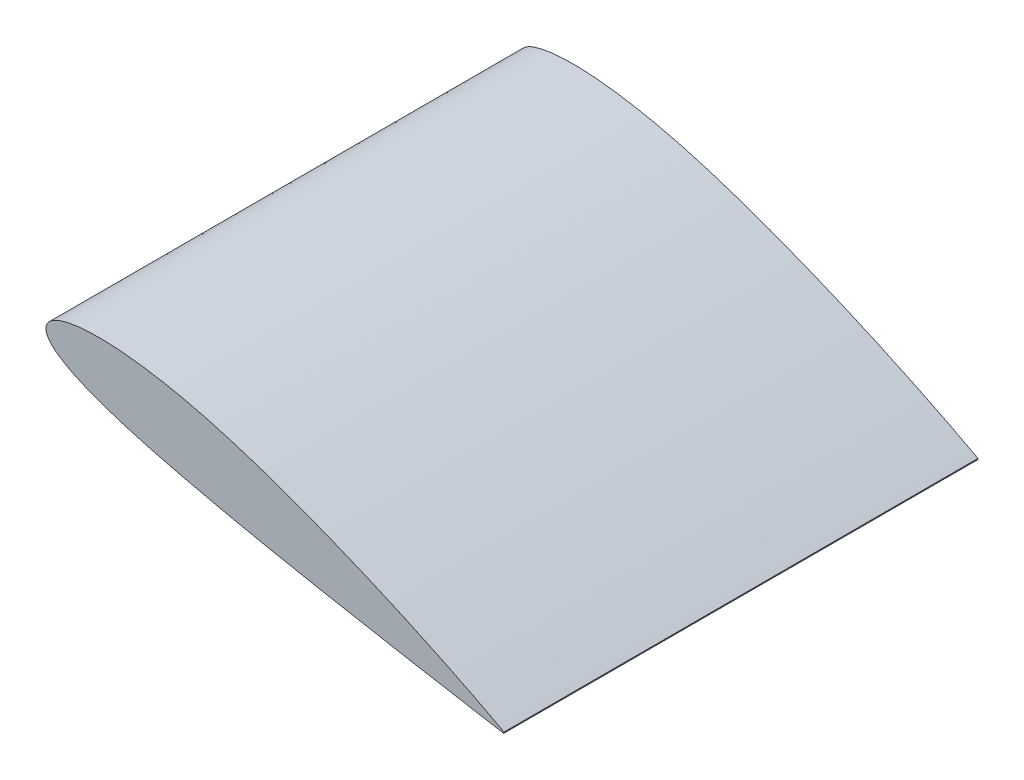
ISO-10303-21;
HEADER;
FILE_DESCRIPTION(('STEP AP214'),'2;1');
FILE_NAME('part.step','',(''),(''),'','','');
FILE_SCHEMA(('AUTOMOTIVE_DESIGN { 1 0 10303 214 1 1 1 1 }'));
ENDSEC;
DATA;
#1=APPLICATION_CONTEXT('core data for automotive mechanical design processes');
#2=APPLICATION_PROTOCOL_DEFINITION('international standard','automotive_design',2000,#1);
#3=PRODUCT_CONTEXT('',#1,'mechanical');
#4=PRODUCT('Part','Part','',(#3));
#5=PRODUCT_RELATED_PRODUCT_CATEGORY('part','',(#4));
#6=PRODUCT_DEFINITION_FORMATION('','',#4);
#7=PRODUCT_DEFINITION_CONTEXT('part definition',#1,'design');
#8=PRODUCT_DEFINITION('design','',#6,#7);
#9=PRODUCT_DEFINITION_SHAPE('','',#8);
#10=(LENGTH_UNIT() NAMED_UNIT(*) SI_UNIT(.MILLI.,.METRE.));
#11=(NAMED_UNIT(*) PLANE_ANGLE_UNIT() SI_UNIT($,.RADIAN.));
#12=(NAMED_UNIT(*) SI_UNIT($,.STERADIAN.) SOLID_ANGLE_UNIT());
#13=UNCERTAINTY_MEASURE_WITH_UNIT(LENGTH_MEASURE(1.E-05),#10,'distance_accuracy_value','');
#14=(GEOMETRIC_REPRESENTATION_CONTEXT(3) GLOBAL_UNCERTAINTY_ASSIGNED_CONTEXT((#13)) GLOBAL_UNIT_ASSIGNED_CONTEXT((#10,
#11,#12)) REPRESENTATION_CONTEXT('',''));
#15=CARTESIAN_POINT('',(0.,0.,0.));
#16=DIRECTION('',(0.,0.,1.));
#17=DIRECTION('',(1.,0.,0.));
#18=AXIS2_PLACEMENT_3D('',#15,#16,#17);
#19=CARTESIAN_POINT('',(483.153145142684,-128.699567068938,500.));
#20=CARTESIAN_POINT('',(482.760443042784,-128.485001291604,500.));
#21=CARTESIAN_POINT('',(481.152201148743,-127.606285154807,500.));
#22=CARTESIAN_POINT('',(477.497476605403,-125.691079143902,500.));
#23=CARTESIAN_POINT('',(471.441257264133,-122.489744920785,500.));
#24=CARTESIAN_POINT('',(463.026613018039,-118.11509943225,500.));
#25=CARTESIAN_POINT('',(452.345106783551,-112.62997581386,500.));
#26=CARTESIAN_POINT('',(433.897381535737,-103.349384710379,500.));
#27=CARTESIAN_POINT('',(406.102946731445,-89.8365600786093,500.));
#28=CARTESIAN_POINT('',(367.792917607618,-72.1633353015507,500.));
#29=CARTESIAN_POINT('',(332.096912654549,-56.7160300352404,500.));
#30=CARTESIAN_POINT('',(301.243475680154,-44.1204077536732,500.));
#31=CARTESIAN_POINT('',(277.008835324866,-34.644617390542,500.));
#32=CARTESIAN_POINT('',(252.354053994253,-25.5019516223064,500.));
#33=CARTESIAN_POINT('',(227.542541225636,-16.8216969550425,500.));
#34=CARTESIAN_POINT('',(202.765846228818,-8.72382775869694,500.));
#35=CARTESIAN_POINT('',(178.251646710438,-1.47741831033578,500.));
#36=CARTESIAN_POINT('',(154.260209482873,4.72456968096018,500.));
#37=CARTESIAN_POINT('',(131.152862772358,9.80032631856836,500.));
#38=CARTESIAN_POINT('',(109.203104562417,13.6939448626124,500.));
#39=CARTESIAN_POINT('',(88.6779935415049,16.4037864331845,500.));
#40=CARTESIAN_POINT('',(69.8233214822749,17.9148570507203,500.));
#41=CARTESIAN_POINT('',(52.8715425898663,18.2988475716767,500.));
#42=CARTESIAN_POINT('',(38.0242536403865,17.6022665419351,500.));
#43=CARTESIAN_POINT('',(25.4461239600212,15.9278786860407,500.));
#44=CARTESIAN_POINT('',(15.2448902691294,13.3534164734014,500.));
#45=CARTESIAN_POINT('',(7.47694816871653,9.93979437590695,500.));
#46=CARTESIAN_POINT('',(2.08010641090954,5.60339422941307,500.));
#47=CARTESIAN_POINT('',(-0.517224740729613,0.0835053089808721,500.));
#48=CARTESIAN_POINT('',(0.181692292498427,-5.96534264150699,500.));
#49=CARTESIAN_POINT('',(3.84896532871038,-11.7940151293945,500.));
#50=CARTESIAN_POINT('',(9.98510204555674,-17.5326232717733,500.));
#51=CARTESIAN_POINT('',(18.5638835297095,-23.3460591710052,500.));
#52=CARTESIAN_POINT('',(29.5377647164318,-29.2084040157829,500.));
#53=CARTESIAN_POINT('',(42.8082767836073,-35.0794045442819,500.));
#54=CARTESIAN_POINT('',(58.2303368285396,-40.9270600444449,500.));
#55=CARTESIAN_POINT('',(75.6437247750505,-46.7074809041352,500.));
#56=CARTESIAN_POINT('',(94.8570096987064,-52.4039739620889,500.));
#57=CARTESIAN_POINT('',(115.660864853715,-58.0206395756028,500.));
#58=CARTESIAN_POINT('',(137.832754480381,-63.5492841697353,500.));
#59=CARTESIAN_POINT('',(161.129716808955,-69.0182017225116,500.));
#60=CARTESIAN_POINT('',(185.370085368101,-74.4695597344071,500.));
#61=CARTESIAN_POINT('',(210.300604660101,-79.8783971709178,500.));
#62=CARTESIAN_POINT('',(235.679074389243,-85.0898250815913,500.));
#63=CARTESIAN_POINT('',(261.139191780429,-90.115282821685,500.));
#64=CARTESIAN_POINT('',(294.393026282498,-96.509376643992,500.));
#65=CARTESIAN_POINT('',(334.044798347036,-103.866441711312,500.));
#66=CARTESIAN_POINT('',(371.975536309114,-110.753455363749,500.));
#67=CARTESIAN_POINT('',(405.181960714363,-116.67757139409,500.));
#68=CARTESIAN_POINT('',(428.210314958867,-120.749589007843,500.));
#69=CARTESIAN_POINT('',(448.480685072506,-124.262483981757,500.));
#70=CARTESIAN_POINT('',(460.285689024104,-126.300919483089,500.));
#71=CARTESIAN_POINT('',(469.618381044799,-127.890197699794,500.));
#72=CARTESIAN_POINT('',(476.362783691693,-129.039750958916,500.));
#73=CARTESIAN_POINT('',(480.462154435631,-129.717713096965,500.));
#74=CARTESIAN_POINT('',(482.299488426565,-130.037197122395,500.));
#75=CARTESIAN_POINT('',(482.772681146384,-130.119478033583,500.));
#76=B_SPLINE_CURVE_WITH_KNOTS('',3,(#19,#20,#21,#22,#23,#24,#25,#26,#27,#28,#29,#30,#31,#32,#33,
#34,#35,#36,#37,#38,#39,#40,#41,#42,#43,#44,#45,#46,#47,#48,#49,#50,#51,#52,#53,#54,#55,#56,#57,
#58,#59,#60,#61,#62,#63,#64,#65,#66,#67,#68,#69,#70,#71,#72,#73,#74,#75),.UNSPECIFIED.,.F.,.F.,
(4,1,1,1,1,1,1,1,1,1,1,1,1,1,1,1,1,1,1,1,1,1,1,1,1,1,1,1,1,1,1,1,1,1,1,1,1,1,1,1,1,1,1,1,1,1,1,
1,1,1,1,1,1,1,4),(0.,0.00130837081542839,0.00535820093360155,0.0120634085253878,
0.0213373007121304,0.0330866187411575,0.0471706431167192,0.0817143521603722,0.123442225424641,
0.170516869891991,0.195424313078073,0.220875125128334,0.246594093158621,0.27230183119837,
0.297725323194622,0.322799376279139,0.347028843152348,0.370161526826169,0.391953614266856,
0.412187725503294,0.430670139078719,0.447230521373444,0.461731544762895,0.474085211958424,
0.484275746782023,0.492391838666874,0.498749378071359,0.504100298021388,0.509453028247956,
0.515789796667128,0.523837665507612,0.533884867180463,0.546005346930758,0.560170801963068,
0.576284399119538,0.59421119075826,0.613803378609794,0.63486930365632,0.657209967038878,
0.680611018884909,0.704834651870993,0.729852897081449,0.755196950720251,0.780582678334603,
0.80572855379656,0.854204496729438,0.898493682913272,0.918442716247676,0.952825660165467,
0.966867903961449,0.97859219917356,0.987851654270917,0.994547443989921,0.998595731738975,1.),.UNSPECIFIED.);
#77=DIRECTION('',(0.,0.,-1.));
#78=VECTOR('',#77,1.);
#79=SURFACE_OF_LINEAR_EXTRUSION('',#76,#78);
#80=CARTESIAN_POINT('',(483.153145142684,-128.699567068938,0.));
#81=CARTESIAN_POINT('',(482.760443042784,-128.485001291604,0.));
#82=CARTESIAN_POINT('',(481.152201148743,-127.606285154807,0.));
#83=CARTESIAN_POINT('',(477.497476605403,-125.691079143902,0.));
#84=CARTESIAN_POINT('',(471.441257264133,-122.489744920785,0.));
#85=CARTESIAN_POINT('',(463.026613018039,-118.11509943225,0.));
#86=CARTESIAN_POINT('',(452.345106783551,-112.62997581386,0.));
#87=CARTESIAN_POINT('',(433.897381535737,-103.349384710379,0.));
#88=CARTESIAN_POINT('',(406.102946731445,-89.8365600786093,0.));
#89=CARTESIAN_POINT('',(367.792917607618,-72.1633353015507,0.));
#90=CARTESIAN_POINT('',(332.096912654549,-56.7160300352404,0.));
#91=CARTESIAN_POINT('',(301.243475680154,-44.1204077536732,0.));
#92=CARTESIAN_POINT('',(277.008835324866,-34.644617390542,0.));
#93=CARTESIAN_POINT('',(252.354053994253,-25.5019516223064,0.));
#94=CARTESIAN_POINT('',(227.542541225636,-16.8216969550425,0.));
#95=CARTESIAN_POINT('',(202.765846228818,-8.72382775869694,0.));
#96=CARTESIAN_POINT('',(178.251646710438,-1.47741831033578,0.));
#97=CARTESIAN_POINT('',(154.260209482873,4.72456968096018,0.));
#98=CARTESIAN_POINT('',(131.152862772358,9.80032631856836,0.));
#99=CARTESIAN_POINT('',(109.203104562417,13.6939448626124,0.));
#100=CARTESIAN_POINT('',(88.6779935415049,16.4037864331845,0.));
#101=CARTESIAN_POINT('',(69.8233214822749,17.9148570507203,0.));
#102=CARTESIAN_POINT('',(52.8715425898663,18.2988475716767,0.));
#103=CARTESIAN_POINT('',(38.0242536403865,17.6022665419351,0.));
#104=CARTESIAN_POINT('',(25.4461239600212,15.9278786860407,0.));
#105=CARTESIAN_POINT('',(15.2448902691294,13.3534164734014,0.));
#106=CARTESIAN_POINT('',(7.47694816871653,9.93979437590695,0.));
#107=CARTESIAN_POINT('',(2.08010641090954,5.60339422941307,0.));
#108=CARTESIAN_POINT('',(-0.517224740729613,0.0835053089808721,0.));
#109=CARTESIAN_POINT('',(0.181692292498427,-5.96534264150699,0.));
#110=CARTESIAN_POINT('',(3.84896532871038,-11.7940151293945,0.));
#111=CARTESIAN_POINT('',(9.98510204555674,-17.5326232717733,0.));
#112=CARTESIAN_POINT('',(18.5638835297095,-23.3460591710052,0.));
#113=CARTESIAN_POINT('',(29.5377647164318,-29.2084040157829,0.));
#114=CARTESIAN_POINT('',(42.8082767836073,-35.0794045442819,0.));
#115=CARTESIAN_POINT('',(58.2303368285396,-40.9270600444449,0.));
#116=CARTESIAN_POINT('',(75.6437247750505,-46.7074809041352,0.));
#117=CARTESIAN_POINT('',(94.8570096987064,-52.4039739620889,0.));
#118=CARTESIAN_POINT('',(115.660864853715,-58.0206395756028,0.));
#119=CARTESIAN_POINT('',(137.832754480381,-63.5492841697353,0.));
#120=CARTESIAN_POINT('',(161.129716808955,-69.0182017225116,0.));
#121=CARTESIAN_POINT('',(185.370085368101,-74.4695597344071,0.));
#122=CARTESIAN_POINT('',(210.300604660101,-79.8783971709178,0.));
#123=CARTESIAN_POINT('',(235.679074389243,-85.0898250815913,0.));
#124=CARTESIAN_POINT('',(261.139191780429,-90.115282821685,0.));
#125=CARTESIAN_POINT('',(294.393026282498,-96.509376643992,0.));
#126=CARTESIAN_POINT('',(334.044798347036,-103.866441711312,0.));
#127=CARTESIAN_POINT('',(371.975536309114,-110.753455363749,0.));
#128=CARTESIAN_POINT('',(405.181960714363,-116.67757139409,0.));
#129=CARTESIAN_POINT('',(428.210314958867,-120.749589007843,0.));
#130=CARTESIAN_POINT('',(448.480685072506,-124.262483981757,0.));
#131=CARTESIAN_POINT('',(460.285689024104,-126.300919483089,0.));
#132=CARTESIAN_POINT('',(469.618381044799,-127.890197699794,0.));
#133=CARTESIAN_POINT('',(476.362783691693,-129.039750958916,0.));
#134=CARTESIAN_POINT('',(480.462154435631,-129.717713096965,0.));
#135=CARTESIAN_POINT('',(482.299488426565,-130.037197122395,0.));
#136=CARTESIAN_POINT('',(482.772681146384,-130.119478033583,0.));
#137=B_SPLINE_CURVE_WITH_KNOTS('',3,(#80,#81,#82,#83,#84,#85,#86,#87,#88,#89,#90,#91,#92,#93,
#94,#95,#96,#97,#98,#99,#100,#101,#102,#103,#104,#105,#106,#107,#108,#109,#110,#111,#112,#113,
#114,#115,#116,#117,#118,#119,#120,#121,#122,#123,#124,#125,#126,#127,#128,#129,#130,#131,#132,
#133,#134,#135,#136),.UNSPECIFIED.,.F.,.F.,(4,1,1,1,1,1,1,1,1,1,1,1,1,1,1,1,1,1,1,1,1,1,1,1,1,1,
1,1,1,1,1,1,1,1,1,1,1,1,1,1,1,1,1,1,1,1,1,1,1,1,1,1,1,1,4),(0.,0.00130837081542839,
0.00535820093360155,0.0120634085253878,0.0213373007121304,0.0330866187411575,0.0471706431167192,
0.0817143521603722,0.123442225424641,0.170516869891991,0.195424313078073,0.220875125128334,
0.246594093158621,0.27230183119837,0.297725323194622,0.322799376279139,0.347028843152348,
0.370161526826169,0.391953614266856,0.412187725503294,0.430670139078719,0.447230521373444,
0.461731544762895,0.474085211958424,0.484275746782023,0.492391838666874,0.498749378071359,
0.504100298021388,0.509453028247956,0.515789796667128,0.523837665507612,0.533884867180463,
0.546005346930758,0.560170801963068,0.576284399119538,0.59421119075826,0.613803378609794,
0.63486930365632,0.657209967038878,0.680611018884909,0.704834651870993,0.729852897081449,
0.755196950720251,0.780582678334603,0.80572855379656,0.854204496729438,0.898493682913272,
0.918442716247676,0.952825660165467,0.966867903961449,0.97859219917356,0.987851654270917,
0.994547443989921,0.998595731738975,1.),.UNSPECIFIED.);
#138=CARTESIAN_POINT('',(483.153145142684,-128.699567068938,0.));
#139=VERTEX_POINT('',#138);
#140=CARTESIAN_POINT('',(482.772681146384,-130.119478033583,0.));
#141=VERTEX_POINT('',#140);
#142=EDGE_CURVE('E81',#139,#141,#137,.T.);
#143=ORIENTED_EDGE('',*,*,#142,.T.);
#144=DIRECTION('',(0.,0.,-1.));
#145=VECTOR('',#144,1.);
#146=CARTESIAN_POINT('',(482.772681146384,-130.119478033583,500.));
#147=LINE('',#146,#145);
#148=CARTESIAN_POINT('',(482.772681146384,-130.119478033583,500.));
#149=VERTEX_POINT('',#148);
#150=EDGE_CURVE('E12',#149,#141,#147,.T.);
#151=ORIENTED_EDGE('',*,*,#150,.F.);
#152=CARTESIAN_POINT('',(483.153145142684,-128.699567068938,500.));
#153=VERTEX_POINT('',#152);
#154=EDGE_CURVE('E80',#153,#149,#76,.T.);
#155=ORIENTED_EDGE('',*,*,#154,.F.);
#156=DIRECTION('',(0.,0.,-1.));
#157=VECTOR('',#156,1.);
#158=CARTESIAN_POINT('',(483.153145142684,-128.699567068938,500.));
#159=LINE('',#158,#157);
#160=EDGE_CURVE('E57',#153,#139,#159,.T.);
#161=ORIENTED_EDGE('',*,*,#160,.T.);
#162=EDGE_LOOP('',(#143,#151,#155,#161));
#163=FACE_BOUND('',#162,.T.);
#164=ADVANCED_FACE('F46',(#163),#79,.F.);
#165=CARTESIAN_POINT('',(483.153145142684,-128.699567068938,500.));
#166=DIRECTION('',(-0.965925826289081,0.258819045102474,0.));
#167=DIRECTION('',(-0.258819045102474,-0.965925826289081,0.));
#168=AXIS2_PLACEMENT_3D('',#165,#166,#167);
#169=PLANE('',#168);
#170=DIRECTION('',(0.258819045102474,0.965925826289081,0.));
#171=VECTOR('',#170,1.);
#172=CARTESIAN_POINT('',(483.153145142684,-128.699567068938,0.));
#173=LINE('',#172,#171);
#174=EDGE_CURVE('E72',#141,#139,#173,.T.);
#175=ORIENTED_EDGE('',*,*,#174,.T.);
#176=ORIENTED_EDGE('',*,*,#160,.F.);
#177=DIRECTION('',(0.258819045102474,0.965925826289081,0.));
#178=VECTOR('',#177,1.);
#179=CARTESIAN_POINT('',(483.153145142684,-128.699567068938,500.));
#180=LINE('',#179,#178);
#181=EDGE_CURVE('E64',#149,#153,#180,.T.);
#182=ORIENTED_EDGE('',*,*,#181,.F.);
#183=ORIENTED_EDGE('',*,*,#150,.T.);
#184=EDGE_LOOP('',(#175,#176,#182,#183));
#185=FACE_BOUND('',#184,.T.);
#186=ADVANCED_FACE('F75',(#185),#169,.F.);
#187=CARTESIAN_POINT('',(1.49432400665778,3.94747613958047,500.));
#188=DIRECTION('',(0.,0.,-1.));
#189=DIRECTION('',(-1.,0.,0.));
#190=AXIS2_PLACEMENT_3D('',#187,#188,#189);
#191=PLANE('',#190);
#192=ORIENTED_EDGE('',*,*,#154,.T.);
#193=ORIENTED_EDGE('',*,*,#181,.T.);
#194=EDGE_LOOP('',(#192,#193));
#195=FACE_BOUND('',#194,.T.);
#196=ADVANCED_FACE('F123',(#195),#191,.F.);
#197=CARTESIAN_POINT('',(1.49432400665778,3.94747613958047,0.));
#198=DIRECTION('',(0.,0.,-1.));
#199=DIRECTION('',(-1.,0.,0.));
#200=AXIS2_PLACEMENT_3D('',#197,#198,#199);
#201=PLANE('',#200);
#202=ORIENTED_EDGE('',*,*,#142,.F.);
#203=ORIENTED_EDGE('',*,*,#174,.F.);
#204=EDGE_LOOP('',(#202,#203));
#205=FACE_BOUND('',#204,.T.);
#206=ADVANCED_FACE('F85',(#205),#201,.T.);
#207=CLOSED_SHELL('',(#164,#186,#196,#206));
#208=MANIFOLD_SOLID_BREP('B2',#207);
#209=ADVANCED_BREP_SHAPE_REPRESENTATION('',(#18,#208),#14);
#210=SHAPE_DEFINITION_REPRESENTATION(#9,#209);
ENDSEC;
END-ISO-10303-21;
